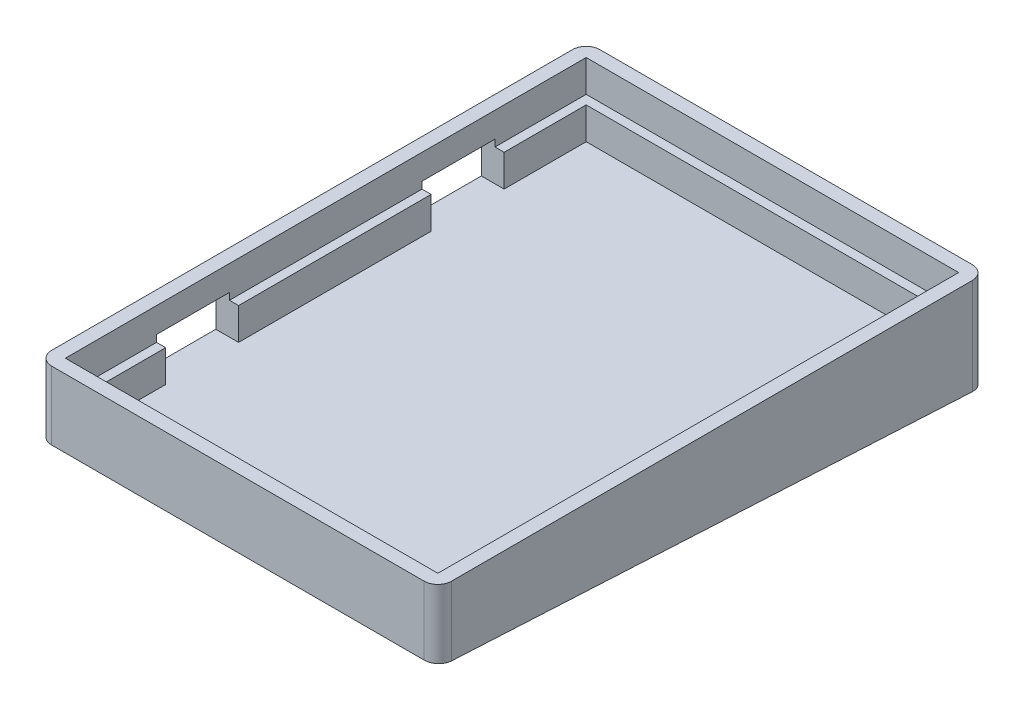
ISO-10303-21;
HEADER;
FILE_DESCRIPTION(('STEP AP214'),'2;1');
FILE_NAME('part.step','',(''),(''),'','','');
FILE_SCHEMA(('AUTOMOTIVE_DESIGN { 1 0 10303 214 1 1 1 1 }'));
ENDSEC;
DATA;
#1=APPLICATION_CONTEXT('core data for automotive mechanical design processes');
#2=APPLICATION_PROTOCOL_DEFINITION('international standard','automotive_design',2000,#1);
#3=PRODUCT_CONTEXT('',#1,'mechanical');
#4=PRODUCT('Part','Part','',(#3));
#5=PRODUCT_RELATED_PRODUCT_CATEGORY('part','',(#4));
#6=PRODUCT_DEFINITION_FORMATION('','',#4);
#7=PRODUCT_DEFINITION_CONTEXT('part definition',#1,'design');
#8=PRODUCT_DEFINITION('design','',#6,#7);
#9=PRODUCT_DEFINITION_SHAPE('','',#8);
#10=(LENGTH_UNIT() NAMED_UNIT(*) SI_UNIT(.MILLI.,.METRE.));
#11=(NAMED_UNIT(*) PLANE_ANGLE_UNIT() SI_UNIT($,.RADIAN.));
#12=(NAMED_UNIT(*) SI_UNIT($,.STERADIAN.) SOLID_ANGLE_UNIT());
#13=UNCERTAINTY_MEASURE_WITH_UNIT(LENGTH_MEASURE(1.E-05),#10,'distance_accuracy_value','');
#14=(GEOMETRIC_REPRESENTATION_CONTEXT(3) GLOBAL_UNCERTAINTY_ASSIGNED_CONTEXT((#13)) GLOBAL_UNIT_ASSIGNED_CONTEXT((#10,
#11,#12)) REPRESENTATION_CONTEXT('',''));
#15=CARTESIAN_POINT('',(0.,0.,0.));
#16=DIRECTION('',(0.,0.,1.));
#17=DIRECTION('',(1.,0.,0.));
#18=AXIS2_PLACEMENT_3D('',#15,#16,#17);
#19=CARTESIAN_POINT('',(0.,0.,0.));
#20=DIRECTION('',(0.,1.,0.));
#21=DIRECTION('',(0.,0.,1.));
#22=AXIS2_PLACEMENT_3D('',#19,#20,#21);
#23=PLANE('',#22);
#24=DIRECTION('',(1.,0.,0.));
#25=VECTOR('',#24,1.);
#26=CARTESIAN_POINT('',(0.,0.,-20.));
#27=LINE('',#26,#25);
#28=CARTESIAN_POINT('',(-3.,0.,-20.));
#29=VERTEX_POINT('',#28);
#30=CARTESIAN_POINT('',(2.,0.,-20.));
#31=VERTEX_POINT('',#30);
#32=EDGE_CURVE('E325',#29,#31,#27,.T.);
#33=ORIENTED_EDGE('',*,*,#32,.T.);
#34=DIRECTION('',(0.,0.,-1.));
#35=VECTOR('',#34,1.);
#36=CARTESIAN_POINT('',(2.,0.,-20.));
#37=LINE('',#36,#35);
#38=CARTESIAN_POINT('',(2.,0.,-2.));
#39=VERTEX_POINT('',#38);
#40=EDGE_CURVE('E819',#39,#31,#37,.T.);
#41=ORIENTED_EDGE('',*,*,#40,.F.);
#42=DIRECTION('',(-1.,0.,0.));
#43=VECTOR('',#42,1.);
#44=CARTESIAN_POINT('',(2.,0.,-2.));
#45=LINE('',#44,#43);
#46=CARTESIAN_POINT('',(79.7,0.,-2.));
#47=VERTEX_POINT('',#46);
#48=EDGE_CURVE('E822',#47,#39,#45,.T.);
#49=ORIENTED_EDGE('',*,*,#48,.F.);
#50=DIRECTION('',(0.,0.,1.));
#51=VECTOR('',#50,1.);
#52=CARTESIAN_POINT('',(79.7,0.,-2.));
#53=LINE('',#52,#51);
#54=CARTESIAN_POINT('',(79.7,0.,-112.24));
#55=VERTEX_POINT('',#54);
#56=EDGE_CURVE('E825',#55,#47,#53,.T.);
#57=ORIENTED_EDGE('',*,*,#56,.F.);
#58=DIRECTION('',(1.,0.,0.));
#59=VECTOR('',#58,1.);
#60=CARTESIAN_POINT('',(79.7,0.,-112.24));
#61=LINE('',#60,#59);
#62=CARTESIAN_POINT('',(2.,0.,-112.24));
#63=VERTEX_POINT('',#62);
#64=EDGE_CURVE('E827',#63,#55,#61,.T.);
#65=ORIENTED_EDGE('',*,*,#64,.F.);
#66=DIRECTION('',(0.,0.,-1.));
#67=VECTOR('',#66,1.);
#68=CARTESIAN_POINT('',(2.,0.,-112.24));
#69=LINE('',#68,#67);
#70=CARTESIAN_POINT('',(2.,0.,-94.24));
#71=VERTEX_POINT('',#70);
#72=EDGE_CURVE('E829',#71,#63,#69,.T.);
#73=ORIENTED_EDGE('',*,*,#72,.F.);
#74=DIRECTION('',(-1.,0.,0.));
#75=VECTOR('',#74,1.);
#76=CARTESIAN_POINT('',(0.,0.,-94.24));
#77=LINE('',#76,#75);
#78=CARTESIAN_POINT('',(-3.,0.,-94.24));
#79=VERTEX_POINT('',#78);
#80=EDGE_CURVE('E338',#71,#79,#77,.T.);
#81=ORIENTED_EDGE('',*,*,#80,.T.);
#82=DIRECTION('',(0.,0.,-1.));
#83=VECTOR('',#82,1.);
#84=CARTESIAN_POINT('',(-3.,0.,0.));
#85=LINE('',#84,#83);
#86=CARTESIAN_POINT('',(-3.,0.,-78.24));
#87=VERTEX_POINT('',#86);
#88=EDGE_CURVE('E316',#87,#79,#85,.T.);
#89=ORIENTED_EDGE('',*,*,#88,.F.);
#90=DIRECTION('',(1.,0.,0.));
#91=VECTOR('',#90,1.);
#92=CARTESIAN_POINT('',(0.,0.,-78.24));
#93=LINE('',#92,#91);
#94=CARTESIAN_POINT('',(2.,0.,-78.24));
#95=VERTEX_POINT('',#94);
#96=EDGE_CURVE('E874',#87,#95,#93,.T.);
#97=ORIENTED_EDGE('',*,*,#96,.T.);
#98=DIRECTION('',(0.,0.,-1.));
#99=VECTOR('',#98,1.);
#100=CARTESIAN_POINT('',(2.,0.,-78.24));
#101=LINE('',#100,#99);
#102=CARTESIAN_POINT('',(2.00000000000001,0.,-36.));
#103=VERTEX_POINT('',#102);
#104=EDGE_CURVE('E831',#103,#95,#101,.T.);
#105=ORIENTED_EDGE('',*,*,#104,.F.);
#106=DIRECTION('',(1.,0.,0.));
#107=VECTOR('',#106,1.);
#108=CARTESIAN_POINT('',(0.,0.,-36.));
#109=LINE('',#108,#107);
#110=CARTESIAN_POINT('',(-3.,0.,-36.));
#111=VERTEX_POINT('',#110);
#112=EDGE_CURVE('E872',#111,#103,#109,.T.);
#113=ORIENTED_EDGE('',*,*,#112,.F.);
#114=EDGE_CURVE('E326',#29,#111,#85,.T.);
#115=ORIENTED_EDGE('',*,*,#114,.F.);
#116=EDGE_LOOP('',(#33,#41,#49,#57,#65,#73,#81,#89,#97,#105,#113,#115));
#117=FACE_BOUND('',#116,.T.);
#118=ADVANCED_FACE('F95',(#117),#23,.T.);
#119=CARTESIAN_POINT('',(0.,14.,-20.));
#120=DIRECTION('',(0.,0.,-1.));
#121=DIRECTION('',(-1.,0.,0.));
#122=AXIS2_PLACEMENT_3D('',#119,#120,#121);
#123=PLANE('',#122);
#124=DIRECTION('',(-1.,0.,0.));
#125=VECTOR('',#124,1.);
#126=CARTESIAN_POINT('',(16.9189243156886,8.5,-20.));
#127=LINE('',#126,#125);
#128=CARTESIAN_POINT('',(0.,8.5,-20.));
#129=VERTEX_POINT('',#128);
#130=CARTESIAN_POINT('',(-3.,8.5,-20.));
#131=VERTEX_POINT('',#130);
#132=EDGE_CURVE('E290',#129,#131,#127,.T.);
#133=ORIENTED_EDGE('',*,*,#132,.F.);
#134=DIRECTION('',(0.,-1.,0.));
#135=VECTOR('',#134,1.);
#136=CARTESIAN_POINT('',(0.,14.,-20.));
#137=LINE('',#136,#135);
#138=CARTESIAN_POINT('',(0.,7.,-20.));
#139=VERTEX_POINT('',#138);
#140=EDGE_CURVE('E288',#129,#139,#137,.T.);
#141=ORIENTED_EDGE('',*,*,#140,.T.);
#142=DIRECTION('',(-1.,0.,0.));
#143=VECTOR('',#142,1.);
#144=CARTESIAN_POINT('',(2.,7.,-20.));
#145=LINE('',#144,#143);
#146=CARTESIAN_POINT('',(2.,7.,-20.));
#147=VERTEX_POINT('',#146);
#148=EDGE_CURVE('E823',#147,#139,#145,.T.);
#149=ORIENTED_EDGE('',*,*,#148,.F.);
#150=DIRECTION('',(0.,-1.,0.));
#151=VECTOR('',#150,1.);
#152=CARTESIAN_POINT('',(2.,7.,-20.));
#153=LINE('',#152,#151);
#154=EDGE_CURVE('E815',#147,#31,#153,.T.);
#155=ORIENTED_EDGE('',*,*,#154,.T.);
#156=ORIENTED_EDGE('',*,*,#32,.F.);
#157=DIRECTION('',(0.,-1.,0.));
#158=VECTOR('',#157,1.);
#159=CARTESIAN_POINT('',(-3.,14.,-20.));
#160=LINE('',#159,#158);
#161=EDGE_CURVE('E110',#131,#29,#160,.T.);
#162=ORIENTED_EDGE('',*,*,#161,.F.);
#163=EDGE_LOOP('',(#133,#141,#149,#155,#156,#162));
#164=FACE_BOUND('',#163,.T.);
#165=ADVANCED_FACE('F454',(#164),#123,.T.);
#166=CARTESIAN_POINT('',(0.,14.,3.));
#167=DIRECTION('',(0.,0.,-1.));
#168=DIRECTION('',(-1.,0.,0.));
#169=AXIS2_PLACEMENT_3D('',#166,#167,#168);
#170=PLANE('',#169);
#171=DIRECTION('',(1.,0.,0.));
#172=VECTOR('',#171,1.);
#173=CARTESIAN_POINT('',(0.,-1.,3.));
#174=LINE('',#173,#172);
#175=CARTESIAN_POINT('',(0.,-1.,3.));
#176=VERTEX_POINT('',#175);
#177=CARTESIAN_POINT('',(81.7,-1.,3.));
#178=VERTEX_POINT('',#177);
#179=EDGE_CURVE('E322',#176,#178,#174,.T.);
#180=ORIENTED_EDGE('',*,*,#179,.T.);
#181=DIRECTION('',(0.,-1.,0.));
#182=VECTOR('',#181,1.);
#183=CARTESIAN_POINT('',(81.7,14.,3.));
#184=LINE('',#183,#182);
#185=CARTESIAN_POINT('',(81.7,14.,3.));
#186=VERTEX_POINT('',#185);
#187=EDGE_CURVE('E12',#178,#186,#184,.F.);
#188=ORIENTED_EDGE('',*,*,#187,.T.);
#189=DIRECTION('',(1.,0.,0.));
#190=VECTOR('',#189,1.);
#191=CARTESIAN_POINT('',(0.,14.,3.));
#192=LINE('',#191,#190);
#193=CARTESIAN_POINT('',(0.,14.,3.));
#194=VERTEX_POINT('',#193);
#195=EDGE_CURVE('E334',#194,#186,#192,.T.);
#196=ORIENTED_EDGE('',*,*,#195,.F.);
#197=DIRECTION('',(0.,-1.,0.));
#198=VECTOR('',#197,1.);
#199=CARTESIAN_POINT('',(0.,-0.999999999999999,3.));
#200=LINE('',#199,#198);
#201=EDGE_CURVE('E103',#194,#176,#200,.T.);
#202=ORIENTED_EDGE('',*,*,#201,.T.);
#203=EDGE_LOOP('',(#180,#188,#196,#202));
#204=FACE_BOUND('',#203,.T.);
#205=ADVANCED_FACE('F409',(#204),#170,.F.);
#206=CARTESIAN_POINT('',(84.7,14.,0.));
#207=DIRECTION('',(-1.,0.,0.));
#208=DIRECTION('',(0.,0.,1.));
#209=AXIS2_PLACEMENT_3D('',#206,#207,#208);
#210=PLANE('',#209);
#211=DIRECTION('',(0.,-0.0523359562429372,-0.998629534754574));
#212=VECTOR('',#211,1.);
#213=CARTESIAN_POINT('',(84.7,-7.30151138099207,-117.24));
#214=LINE('',#213,#212);
#215=CARTESIAN_POINT('',(84.7,-1.1572233378491,0.));
#216=VERTEX_POINT('',#215);
#217=CARTESIAN_POINT('',(84.7,-7.14428804314296,-114.24));
#218=VERTEX_POINT('',#217);
#219=EDGE_CURVE('E313',#216,#218,#214,.T.);
#220=ORIENTED_EDGE('',*,*,#219,.T.);
#221=DIRECTION('',(0.,-1.,0.));
#222=VECTOR('',#221,1.);
#223=CARTESIAN_POINT('',(84.7,14.,-114.24));
#224=LINE('',#223,#222);
#225=CARTESIAN_POINT('',(84.7,14.,-114.24));
#226=VERTEX_POINT('',#225);
#227=EDGE_CURVE('E403',#218,#226,#224,.F.);
#228=ORIENTED_EDGE('',*,*,#227,.T.);
#229=DIRECTION('',(0.,0.,-1.));
#230=VECTOR('',#229,1.);
#231=CARTESIAN_POINT('',(84.7,14.,0.));
#232=LINE('',#231,#230);
#233=CARTESIAN_POINT('',(84.7,14.,0.));
#234=VERTEX_POINT('',#233);
#235=EDGE_CURVE('E337',#234,#226,#232,.T.);
#236=ORIENTED_EDGE('',*,*,#235,.F.);
#237=DIRECTION('',(0.,-1.,0.));
#238=VECTOR('',#237,1.);
#239=CARTESIAN_POINT('',(84.7,14.,0.));
#240=LINE('',#239,#238);
#241=EDGE_CURVE('E400',#234,#216,#240,.T.);
#242=ORIENTED_EDGE('',*,*,#241,.T.);
#243=EDGE_LOOP('',(#220,#228,#236,#242));
#244=FACE_BOUND('',#243,.T.);
#245=ADVANCED_FACE('F423',(#244),#210,.F.);
#246=CARTESIAN_POINT('',(0.,14.,-117.24));
#247=DIRECTION('',(0.,0.,1.));
#248=DIRECTION('',(1.,0.,0.));
#249=AXIS2_PLACEMENT_3D('',#246,#247,#248);
#250=PLANE('',#249);
#251=DIRECTION('',(-1.,0.,0.));
#252=VECTOR('',#251,1.);
#253=CARTESIAN_POINT('',(205.161486245384,-7.30151138099207,-117.24));
#254=LINE('',#253,#252);
#255=CARTESIAN_POINT('',(81.7,-7.30151138099207,-117.24));
#256=VERTEX_POINT('',#255);
#257=CARTESIAN_POINT('',(0.,-7.30151138099207,-117.24));
#258=VERTEX_POINT('',#257);
#259=EDGE_CURVE('E317',#256,#258,#254,.T.);
#260=ORIENTED_EDGE('',*,*,#259,.T.);
#261=DIRECTION('',(0.,-1.,0.));
#262=VECTOR('',#261,1.);
#263=CARTESIAN_POINT('',(0.,14.,-117.24));
#264=LINE('',#263,#262);
#265=CARTESIAN_POINT('',(0.,14.,-117.24));
#266=VERTEX_POINT('',#265);
#267=EDGE_CURVE('E390',#258,#266,#264,.F.);
#268=ORIENTED_EDGE('',*,*,#267,.T.);
#269=DIRECTION('',(-1.,0.,0.));
#270=VECTOR('',#269,1.);
#271=CARTESIAN_POINT('',(0.,14.,-117.24));
#272=LINE('',#271,#270);
#273=CARTESIAN_POINT('',(81.7,14.,-117.24));
#274=VERTEX_POINT('',#273);
#275=EDGE_CURVE('E333',#274,#266,#272,.T.);
#276=ORIENTED_EDGE('',*,*,#275,.F.);
#277=DIRECTION('',(0.,-1.,0.));
#278=VECTOR('',#277,1.);
#279=CARTESIAN_POINT('',(81.7,14.,-117.24));
#280=LINE('',#279,#278);
#281=EDGE_CURVE('E387',#274,#256,#280,.T.);
#282=ORIENTED_EDGE('',*,*,#281,.T.);
#283=EDGE_LOOP('',(#260,#268,#276,#282));
#284=FACE_BOUND('',#283,.T.);
#285=ADVANCED_FACE('F435',(#284),#250,.F.);
#286=CARTESIAN_POINT('',(-3.,14.,0.));
#287=DIRECTION('',(-1.,0.,0.));
#288=DIRECTION('',(0.,0.,1.));
#289=AXIS2_PLACEMENT_3D('',#286,#287,#288);
#290=PLANE('',#289);
#291=DIRECTION('',(0.,0.,1.));
#292=VECTOR('',#291,1.);
#293=CARTESIAN_POINT('',(-3.,8.5,-36.));
#294=LINE('',#293,#292);
#295=CARTESIAN_POINT('',(-3.,8.5,-36.));
#296=VERTEX_POINT('',#295);
#297=EDGE_CURVE('E296',#296,#131,#294,.T.);
#298=ORIENTED_EDGE('',*,*,#297,.T.);
#299=ORIENTED_EDGE('',*,*,#161,.T.);
#300=ORIENTED_EDGE('',*,*,#114,.T.);
#301=DIRECTION('',(0.,-1.,0.));
#302=VECTOR('',#301,1.);
#303=CARTESIAN_POINT('',(-3.,14.,-36.));
#304=LINE('',#303,#302);
#305=EDGE_CURVE('E304',#296,#111,#304,.T.);
#306=ORIENTED_EDGE('',*,*,#305,.F.);
#307=EDGE_LOOP('',(#298,#299,#300,#306));
#308=FACE_BOUND('',#307,.T.);
#309=DIRECTION('',(0.,-1.,0.));
#310=VECTOR('',#309,1.);
#311=CARTESIAN_POINT('',(-3.,14.,-94.24));
#312=LINE('',#311,#310);
#313=CARTESIAN_POINT('',(-3.,8.5,-94.24));
#314=VERTEX_POINT('',#313);
#315=EDGE_CURVE('E370',#314,#79,#312,.T.);
#316=ORIENTED_EDGE('',*,*,#315,.F.);
#317=DIRECTION('',(0.,0.,1.));
#318=VECTOR('',#317,1.);
#319=CARTESIAN_POINT('',(-3.,8.5,-94.24));
#320=LINE('',#319,#318);
#321=CARTESIAN_POINT('',(-3.,8.5,-78.24));
#322=VERTEX_POINT('',#321);
#323=EDGE_CURVE('E802',#314,#322,#320,.T.);
#324=ORIENTED_EDGE('',*,*,#323,.T.);
#325=DIRECTION('',(0.,-1.,0.));
#326=VECTOR('',#325,1.);
#327=CARTESIAN_POINT('',(-3.,14.,-78.24));
#328=LINE('',#327,#326);
#329=EDGE_CURVE('E309',#322,#87,#328,.T.);
#330=ORIENTED_EDGE('',*,*,#329,.T.);
#331=ORIENTED_EDGE('',*,*,#88,.T.);
#332=EDGE_LOOP('',(#316,#324,#330,#331));
#333=FACE_BOUND('',#332,.T.);
#334=DIRECTION('',(0.,0.,-1.));
#335=VECTOR('',#334,1.);
#336=CARTESIAN_POINT('',(-3.,14.,0.));
#337=LINE('',#336,#335);
#338=CARTESIAN_POINT('',(-3.,14.,0.));
#339=VERTEX_POINT('',#338);
#340=CARTESIAN_POINT('',(-3.,14.,-114.24));
#341=VERTEX_POINT('',#340);
#342=EDGE_CURVE('E329',#339,#341,#337,.T.);
#343=ORIENTED_EDGE('',*,*,#342,.T.);
#344=DIRECTION('',(0.,-1.,0.));
#345=VECTOR('',#344,1.);
#346=CARTESIAN_POINT('',(-3.,-7.30151138099207,-114.24));
#347=LINE('',#346,#345);
#348=CARTESIAN_POINT('',(-3.,-7.14428804314296,-114.24));
#349=VERTEX_POINT('',#348);
#350=EDGE_CURVE('E376',#341,#349,#347,.T.);
#351=ORIENTED_EDGE('',*,*,#350,.T.);
#352=DIRECTION('',(0.,0.0523359562429372,0.998629534754574));
#353=VECTOR('',#352,1.);
#354=CARTESIAN_POINT('',(-3.,-7.30151138099207,-117.24));
#355=LINE('',#354,#353);
#356=CARTESIAN_POINT('',(-3.,-1.1572233378491,0.));
#357=VERTEX_POINT('',#356);
#358=EDGE_CURVE('E307',#349,#357,#355,.T.);
#359=ORIENTED_EDGE('',*,*,#358,.T.);
#360=DIRECTION('',(0.,-1.,0.));
#361=VECTOR('',#360,1.);
#362=CARTESIAN_POINT('',(-3.,14.,0.));
#363=LINE('',#362,#361);
#364=EDGE_CURVE('E373',#357,#339,#363,.F.);
#365=ORIENTED_EDGE('',*,*,#364,.T.);
#366=EDGE_LOOP('',(#343,#351,#359,#365));
#367=FACE_BOUND('',#366,.T.);
#368=ADVANCED_FACE('F442',(#308,#333,#367),#290,.T.);
#369=CARTESIAN_POINT('',(0.,14.,-94.24));
#370=DIRECTION('',(0.,0.,1.));
#371=DIRECTION('',(1.,0.,0.));
#372=AXIS2_PLACEMENT_3D('',#369,#370,#371);
#373=PLANE('',#372);
#374=DIRECTION('',(-1.,0.,0.));
#375=VECTOR('',#374,1.);
#376=CARTESIAN_POINT('',(16.9189243156886,8.5,-94.24));
#377=LINE('',#376,#375);
#378=CARTESIAN_POINT('',(0.,8.5,-94.24));
#379=VERTEX_POINT('',#378);
#380=EDGE_CURVE('E118',#379,#314,#377,.T.);
#381=ORIENTED_EDGE('',*,*,#380,.T.);
#382=ORIENTED_EDGE('',*,*,#315,.T.);
#383=ORIENTED_EDGE('',*,*,#80,.F.);
#384=DIRECTION('',(0.,-1.,0.));
#385=VECTOR('',#384,1.);
#386=CARTESIAN_POINT('',(2.,7.,-94.24));
#387=LINE('',#386,#385);
#388=CARTESIAN_POINT('',(2.,7.,-94.24));
#389=VERTEX_POINT('',#388);
#390=EDGE_CURVE('E793',#389,#71,#387,.T.);
#391=ORIENTED_EDGE('',*,*,#390,.F.);
#392=DIRECTION('',(1.,0.,0.));
#393=VECTOR('',#392,1.);
#394=CARTESIAN_POINT('',(2.,7.,-94.24));
#395=LINE('',#394,#393);
#396=CARTESIAN_POINT('',(0.,7.,-94.24));
#397=VERTEX_POINT('',#396);
#398=EDGE_CURVE('E841',#397,#389,#395,.T.);
#399=ORIENTED_EDGE('',*,*,#398,.F.);
#400=DIRECTION('',(0.,-1.,0.));
#401=VECTOR('',#400,1.);
#402=CARTESIAN_POINT('',(0.,14.,-94.24));
#403=LINE('',#402,#401);
#404=EDGE_CURVE('E368',#379,#397,#403,.T.);
#405=ORIENTED_EDGE('',*,*,#404,.F.);
#406=EDGE_LOOP('',(#381,#382,#383,#391,#399,#405));
#407=FACE_BOUND('',#406,.T.);
#408=ADVANCED_FACE('F479',(#407),#373,.T.);
#409=CARTESIAN_POINT('',(0.,14.,-114.24));
#410=DIRECTION('',(0.,0.,1.));
#411=DIRECTION('',(1.,0.,0.));
#412=AXIS2_PLACEMENT_3D('',#409,#410,#411);
#413=PLANE('',#412);
#414=DIRECTION('',(-1.,0.,0.));
#415=VECTOR('',#414,1.);
#416=CARTESIAN_POINT('',(81.7,7.,-114.24));
#417=LINE('',#416,#415);
#418=CARTESIAN_POINT('',(81.7,7.,-114.24));
#419=VERTEX_POINT('',#418);
#420=CARTESIAN_POINT('',(0.,7.,-114.24));
#421=VERTEX_POINT('',#420);
#422=EDGE_CURVE('E846',#419,#421,#417,.T.);
#423=ORIENTED_EDGE('',*,*,#422,.F.);
#424=DIRECTION('',(0.,-1.,0.));
#425=VECTOR('',#424,1.);
#426=CARTESIAN_POINT('',(81.7,14.,-114.24));
#427=LINE('',#426,#425);
#428=CARTESIAN_POINT('',(81.7,14.,-114.24));
#429=VERTEX_POINT('',#428);
#430=EDGE_CURVE('E362',#429,#419,#427,.T.);
#431=ORIENTED_EDGE('',*,*,#430,.F.);
#432=DIRECTION('',(-1.,0.,0.));
#433=VECTOR('',#432,1.);
#434=CARTESIAN_POINT('',(0.,14.,-114.24));
#435=LINE('',#434,#433);
#436=CARTESIAN_POINT('',(0.,14.,-114.24));
#437=VERTEX_POINT('',#436);
#438=EDGE_CURVE('E344',#429,#437,#435,.T.);
#439=ORIENTED_EDGE('',*,*,#438,.T.);
#440=DIRECTION('',(0.,-1.,0.));
#441=VECTOR('',#440,1.);
#442=CARTESIAN_POINT('',(0.,14.,-114.24));
#443=LINE('',#442,#441);
#444=EDGE_CURVE('E365',#437,#421,#443,.T.);
#445=ORIENTED_EDGE('',*,*,#444,.T.);
#446=EDGE_LOOP('',(#423,#431,#439,#445));
#447=FACE_BOUND('',#446,.T.);
#448=ADVANCED_FACE('F476',(#447),#413,.T.);
#449=CARTESIAN_POINT('',(81.7,14.,0.));
#450=DIRECTION('',(-1.,0.,0.));
#451=DIRECTION('',(0.,0.,1.));
#452=AXIS2_PLACEMENT_3D('',#449,#450,#451);
#453=PLANE('',#452);
#454=DIRECTION('',(0.,0.,-1.));
#455=VECTOR('',#454,1.);
#456=CARTESIAN_POINT('',(81.7,7.,0.));
#457=LINE('',#456,#455);
#458=CARTESIAN_POINT('',(81.7,7.,0.));
#459=VERTEX_POINT('',#458);
#460=EDGE_CURVE('E848',#459,#419,#457,.T.);
#461=ORIENTED_EDGE('',*,*,#460,.F.);
#462=DIRECTION('',(0.,-1.,0.));
#463=VECTOR('',#462,1.);
#464=CARTESIAN_POINT('',(81.7,14.,0.));
#465=LINE('',#464,#463);
#466=CARTESIAN_POINT('',(81.7,14.,0.));
#467=VERTEX_POINT('',#466);
#468=EDGE_CURVE('E359',#467,#459,#465,.T.);
#469=ORIENTED_EDGE('',*,*,#468,.F.);
#470=DIRECTION('',(0.,0.,-1.));
#471=VECTOR('',#470,1.);
#472=CARTESIAN_POINT('',(81.7,14.,0.));
#473=LINE('',#472,#471);
#474=EDGE_CURVE('E347',#467,#429,#473,.T.);
#475=ORIENTED_EDGE('',*,*,#474,.T.);
#476=ORIENTED_EDGE('',*,*,#430,.T.);
#477=EDGE_LOOP('',(#461,#469,#475,#476));
#478=FACE_BOUND('',#477,.T.);
#479=ADVANCED_FACE('F472',(#478),#453,.T.);
#480=CARTESIAN_POINT('',(0.,14.,0.));
#481=DIRECTION('',(0.,0.,-1.));
#482=DIRECTION('',(-1.,0.,0.));
#483=AXIS2_PLACEMENT_3D('',#480,#481,#482);
#484=PLANE('',#483);
#485=DIRECTION('',(1.,0.,0.));
#486=VECTOR('',#485,1.);
#487=CARTESIAN_POINT('',(0.,7.,0.));
#488=LINE('',#487,#486);
#489=CARTESIAN_POINT('',(0.,7.,0.));
#490=VERTEX_POINT('',#489);
#491=EDGE_CURVE('E850',#490,#459,#488,.T.);
#492=ORIENTED_EDGE('',*,*,#491,.F.);
#493=DIRECTION('',(0.,-1.,0.));
#494=VECTOR('',#493,1.);
#495=CARTESIAN_POINT('',(0.,14.,0.));
#496=LINE('',#495,#494);
#497=CARTESIAN_POINT('',(0.,14.,0.));
#498=VERTEX_POINT('',#497);
#499=EDGE_CURVE('E357',#498,#490,#496,.T.);
#500=ORIENTED_EDGE('',*,*,#499,.F.);
#501=DIRECTION('',(1.,0.,0.));
#502=VECTOR('',#501,1.);
#503=CARTESIAN_POINT('',(0.,14.,0.));
#504=LINE('',#503,#502);
#505=EDGE_CURVE('E350',#498,#467,#504,.T.);
#506=ORIENTED_EDGE('',*,*,#505,.T.);
#507=ORIENTED_EDGE('',*,*,#468,.T.);
#508=EDGE_LOOP('',(#492,#500,#506,#507));
#509=FACE_BOUND('',#508,.T.);
#510=ADVANCED_FACE('F469',(#509),#484,.T.);
#511=CARTESIAN_POINT('',(0.,14.,0.));
#512=DIRECTION('',(-1.,0.,0.));
#513=DIRECTION('',(0.,0.,1.));
#514=AXIS2_PLACEMENT_3D('',#511,#512,#513);
#515=PLANE('',#514);
#516=ORIENTED_EDGE('',*,*,#499,.T.);
#517=DIRECTION('',(0.,0.,1.));
#518=VECTOR('',#517,1.);
#519=CARTESIAN_POINT('',(0.,7.,-20.));
#520=LINE('',#519,#518);
#521=EDGE_CURVE('E852',#139,#490,#520,.T.);
#522=ORIENTED_EDGE('',*,*,#521,.F.);
#523=ORIENTED_EDGE('',*,*,#140,.F.);
#524=DIRECTION('',(0.,0.,-1.));
#525=VECTOR('',#524,1.);
#526=CARTESIAN_POINT('',(0.,8.5,-36.));
#527=LINE('',#526,#525);
#528=CARTESIAN_POINT('',(0.,8.5,-36.));
#529=VERTEX_POINT('',#528);
#530=EDGE_CURVE('E279',#129,#529,#527,.T.);
#531=ORIENTED_EDGE('',*,*,#530,.T.);
#532=DIRECTION('',(0.,-1.,0.));
#533=VECTOR('',#532,1.);
#534=CARTESIAN_POINT('',(0.,14.,-36.));
#535=LINE('',#534,#533);
#536=CARTESIAN_POINT('',(0.,7.,-36.));
#537=VERTEX_POINT('',#536);
#538=EDGE_CURVE('E285',#529,#537,#535,.T.);
#539=ORIENTED_EDGE('',*,*,#538,.T.);
#540=DIRECTION('',(0.,0.,1.));
#541=VECTOR('',#540,1.);
#542=CARTESIAN_POINT('',(0.,7.,-78.24));
#543=LINE('',#542,#541);
#544=CARTESIAN_POINT('',(0.,7.,-78.24));
#545=VERTEX_POINT('',#544);
#546=EDGE_CURVE('E856',#545,#537,#543,.T.);
#547=ORIENTED_EDGE('',*,*,#546,.F.);
#548=DIRECTION('',(0.,-1.,0.));
#549=VECTOR('',#548,1.);
#550=CARTESIAN_POINT('',(0.,14.,-78.24));
#551=LINE('',#550,#549);
#552=CARTESIAN_POINT('',(0.,8.5,-78.24));
#553=VERTEX_POINT('',#552);
#554=EDGE_CURVE('E305',#553,#545,#551,.T.);
#555=ORIENTED_EDGE('',*,*,#554,.F.);
#556=DIRECTION('',(0.,0.,-1.));
#557=VECTOR('',#556,1.);
#558=CARTESIAN_POINT('',(0.,8.5,-94.24));
#559=LINE('',#558,#557);
#560=EDGE_CURVE('E788',#553,#379,#559,.T.);
#561=ORIENTED_EDGE('',*,*,#560,.T.);
#562=ORIENTED_EDGE('',*,*,#404,.T.);
#563=DIRECTION('',(0.,0.,1.));
#564=VECTOR('',#563,1.);
#565=CARTESIAN_POINT('',(0.,7.,-114.24));
#566=LINE('',#565,#564);
#567=EDGE_CURVE('E843',#421,#397,#566,.T.);
#568=ORIENTED_EDGE('',*,*,#567,.F.);
#569=ORIENTED_EDGE('',*,*,#444,.F.);
#570=DIRECTION('',(0.,0.,-1.));
#571=VECTOR('',#570,1.);
#572=CARTESIAN_POINT('',(0.,14.,0.));
#573=LINE('',#572,#571);
#574=EDGE_CURVE('E332',#498,#437,#573,.T.);
#575=ORIENTED_EDGE('',*,*,#574,.F.);
#576=EDGE_LOOP('',(#516,#522,#523,#531,#539,#547,#555,#561,#562,#568,#569,#575));
#577=FACE_BOUND('',#576,.T.);
#578=ADVANCED_FACE('F282',(#577),#515,.F.);
#579=CARTESIAN_POINT('',(0.,14.,0.));
#580=DIRECTION('',(0.,1.,0.));
#581=DIRECTION('',(0.,0.,1.));
#582=AXIS2_PLACEMENT_3D('',#579,#580,#581);
#583=PLANE('',#582);
#584=ORIENTED_EDGE('',*,*,#342,.F.);
#585=CARTESIAN_POINT('',(0.,14.,0.));
#586=DIRECTION('',(0.,1.,0.));
#587=DIRECTION('',(0.,0.,1.));
#588=AXIS2_PLACEMENT_3D('',#585,#586,#587);
#589=CIRCLE('',#588,3.);
#590=EDGE_CURVE('E392',#339,#194,#589,.T.);
#591=ORIENTED_EDGE('',*,*,#590,.T.);
#592=ORIENTED_EDGE('',*,*,#195,.T.);
#593=CARTESIAN_POINT('',(81.7,14.,0.));
#594=DIRECTION('',(0.,1.,0.));
#595=DIRECTION('',(0.,0.,1.));
#596=AXIS2_PLACEMENT_3D('',#593,#594,#595);
#597=CIRCLE('',#596,3.);
#598=EDGE_CURVE('E394',#186,#234,#597,.T.);
#599=ORIENTED_EDGE('',*,*,#598,.T.);
#600=ORIENTED_EDGE('',*,*,#235,.T.);
#601=CARTESIAN_POINT('',(81.7,14.,-114.24));
#602=DIRECTION('',(0.,1.,0.));
#603=DIRECTION('',(0.,0.,1.));
#604=AXIS2_PLACEMENT_3D('',#601,#602,#603);
#605=CIRCLE('',#604,3.);
#606=EDGE_CURVE('E396',#226,#274,#605,.T.);
#607=ORIENTED_EDGE('',*,*,#606,.T.);
#608=ORIENTED_EDGE('',*,*,#275,.T.);
#609=CARTESIAN_POINT('',(0.,14.,-114.24));
#610=DIRECTION('',(0.,1.,0.));
#611=DIRECTION('',(0.,0.,1.));
#612=AXIS2_PLACEMENT_3D('',#609,#610,#611);
#613=CIRCLE('',#612,3.);
#614=EDGE_CURVE('E398',#266,#341,#613,.T.);
#615=ORIENTED_EDGE('',*,*,#614,.T.);
#616=EDGE_LOOP('',(#584,#591,#592,#599,#600,#607,#608,#615));
#617=FACE_BOUND('',#616,.T.);
#618=ORIENTED_EDGE('',*,*,#505,.F.);
#619=ORIENTED_EDGE('',*,*,#574,.T.);
#620=ORIENTED_EDGE('',*,*,#438,.F.);
#621=ORIENTED_EDGE('',*,*,#474,.F.);
#622=EDGE_LOOP('',(#618,#619,#620,#621));
#623=FACE_BOUND('',#622,.T.);
#624=ADVANCED_FACE('F427',(#617,#623),#583,.T.);
#625=CARTESIAN_POINT('',(205.161486245384,-7.30151138099207,-117.24));
#626=DIRECTION('',(0.,-0.998629534754574,0.0523359562429372));
#627=DIRECTION('',(0.,-0.0523359562429372,-0.998629534754574));
#628=AXIS2_PLACEMENT_3D('',#625,#626,#627);
#629=PLANE('',#628);
#630=ORIENTED_EDGE('',*,*,#358,.F.);
#631=CARTESIAN_POINT('',(0.,-7.14428804314296,-114.24));
#632=DIRECTION('',(0.,-0.998629534754574,0.0523359562429372));
#633=DIRECTION('',(0.,0.0523359562429372,0.998629534754574));
#634=AXIS2_PLACEMENT_3D('',#631,#632,#633);
#635=ELLIPSE('',#634,3.00411703799376,3.);
#636=EDGE_CURVE('E385',#349,#258,#635,.T.);
#637=ORIENTED_EDGE('',*,*,#636,.T.);
#638=ORIENTED_EDGE('',*,*,#259,.F.);
#639=CARTESIAN_POINT('',(81.7,-7.14428804314296,-114.24));
#640=DIRECTION('',(0.,-0.998629534754574,0.0523359562429372));
#641=DIRECTION('',(0.,-0.0523359562429372,-0.998629534754574));
#642=AXIS2_PLACEMENT_3D('',#639,#640,#641);
#643=ELLIPSE('',#642,3.00411703799376,3.);
#644=EDGE_CURVE('E383',#256,#218,#643,.T.);
#645=ORIENTED_EDGE('',*,*,#644,.T.);
#646=ORIENTED_EDGE('',*,*,#219,.F.);
#647=CARTESIAN_POINT('',(81.7,-1.1572233378491,0.));
#648=DIRECTION('',(0.,-0.998629534754574,0.0523359562429372));
#649=DIRECTION('',(0.,-0.0523359562429372,-0.998629534754574));
#650=AXIS2_PLACEMENT_3D('',#647,#648,#649);
#651=ELLIPSE('',#650,3.00411703799376,3.);
#652=EDGE_CURVE('E381',#216,#178,#651,.T.);
#653=ORIENTED_EDGE('',*,*,#652,.T.);
#654=ORIENTED_EDGE('',*,*,#179,.F.);
#655=CARTESIAN_POINT('',(0.,-1.1572233378491,0.));
#656=DIRECTION('',(0.,-0.998629534754574,0.0523359562429372));
#657=DIRECTION('',(0.,0.0523359562429372,0.998629534754574));
#658=AXIS2_PLACEMENT_3D('',#655,#656,#657);
#659=ELLIPSE('',#658,3.00411703799376,3.);
#660=EDGE_CURVE('E379',#176,#357,#659,.T.);
#661=ORIENTED_EDGE('',*,*,#660,.T.);
#662=EDGE_LOOP('',(#630,#637,#638,#645,#646,#653,#654,#661));
#663=FACE_BOUND('',#662,.T.);
#664=ADVANCED_FACE('F415',(#663),#629,.T.);
#665=CARTESIAN_POINT('',(0.,14.,-36.));
#666=DIRECTION('',(0.,0.,-1.));
#667=DIRECTION('',(-1.,0.,0.));
#668=AXIS2_PLACEMENT_3D('',#665,#666,#667);
#669=PLANE('',#668);
#670=ORIENTED_EDGE('',*,*,#538,.F.);
#671=DIRECTION('',(-1.,0.,0.));
#672=VECTOR('',#671,1.);
#673=CARTESIAN_POINT('',(16.9189243156886,8.5,-36.));
#674=LINE('',#673,#672);
#675=EDGE_CURVE('E293',#529,#296,#674,.T.);
#676=ORIENTED_EDGE('',*,*,#675,.T.);
#677=ORIENTED_EDGE('',*,*,#305,.T.);
#678=ORIENTED_EDGE('',*,*,#112,.T.);
#679=DIRECTION('',(0.,-1.,0.));
#680=VECTOR('',#679,1.);
#681=CARTESIAN_POINT('',(2.00000000000001,7.,-36.));
#682=LINE('',#681,#680);
#683=CARTESIAN_POINT('',(2.00000000000001,7.,-36.));
#684=VERTEX_POINT('',#683);
#685=EDGE_CURVE('E869',#684,#103,#682,.T.);
#686=ORIENTED_EDGE('',*,*,#685,.F.);
#687=DIRECTION('',(1.,0.,0.));
#688=VECTOR('',#687,1.);
#689=CARTESIAN_POINT('',(2.00000000000001,7.,-36.));
#690=LINE('',#689,#688);
#691=EDGE_CURVE('E302',#537,#684,#690,.T.);
#692=ORIENTED_EDGE('',*,*,#691,.F.);
#693=EDGE_LOOP('',(#670,#676,#677,#678,#686,#692));
#694=FACE_BOUND('',#693,.T.);
#695=ADVANCED_FACE('F300',(#694),#669,.F.);
#696=CARTESIAN_POINT('',(0.,14.,-78.24));
#697=DIRECTION('',(0.,0.,-1.));
#698=DIRECTION('',(-1.,0.,0.));
#699=AXIS2_PLACEMENT_3D('',#696,#697,#698);
#700=PLANE('',#699);
#701=DIRECTION('',(-1.,0.,0.));
#702=VECTOR('',#701,1.);
#703=CARTESIAN_POINT('',(16.9189243156886,8.5,-78.24));
#704=LINE('',#703,#702);
#705=EDGE_CURVE('E790',#553,#322,#704,.T.);
#706=ORIENTED_EDGE('',*,*,#705,.F.);
#707=ORIENTED_EDGE('',*,*,#554,.T.);
#708=DIRECTION('',(-1.,0.,0.));
#709=VECTOR('',#708,1.);
#710=CARTESIAN_POINT('',(2.,7.,-78.24));
#711=LINE('',#710,#709);
#712=CARTESIAN_POINT('',(2.,7.,-78.24));
#713=VERTEX_POINT('',#712);
#714=EDGE_CURVE('E861',#713,#545,#711,.T.);
#715=ORIENTED_EDGE('',*,*,#714,.F.);
#716=DIRECTION('',(0.,-1.,0.));
#717=VECTOR('',#716,1.);
#718=CARTESIAN_POINT('',(2.,7.,-78.24));
#719=LINE('',#718,#717);
#720=EDGE_CURVE('E864',#713,#95,#719,.T.);
#721=ORIENTED_EDGE('',*,*,#720,.T.);
#722=ORIENTED_EDGE('',*,*,#96,.F.);
#723=ORIENTED_EDGE('',*,*,#329,.F.);
#724=EDGE_LOOP('',(#706,#707,#715,#721,#722,#723));
#725=FACE_BOUND('',#724,.T.);
#726=ADVANCED_FACE('F494',(#725),#700,.T.);
#727=CARTESIAN_POINT('',(0.,14.,-114.24));
#728=DIRECTION('',(0.,1.,0.));
#729=DIRECTION('',(0.,0.,1.));
#730=AXIS2_PLACEMENT_3D('',#727,#728,#729);
#731=CYLINDRICAL_SURFACE('',#730,3.);
#732=ORIENTED_EDGE('',*,*,#614,.F.);
#733=ORIENTED_EDGE('',*,*,#267,.F.);
#734=ORIENTED_EDGE('',*,*,#636,.F.);
#735=ORIENTED_EDGE('',*,*,#350,.F.);
#736=EDGE_LOOP('',(#732,#733,#734,#735));
#737=FACE_BOUND('',#736,.T.);
#738=ADVANCED_FACE('F440',(#737),#731,.T.);
#739=CARTESIAN_POINT('',(81.7,14.,-114.24));
#740=DIRECTION('',(0.,-1.,0.));
#741=DIRECTION('',(0.,0.,-1.));
#742=AXIS2_PLACEMENT_3D('',#739,#740,#741);
#743=CYLINDRICAL_SURFACE('',#742,3.);
#744=ORIENTED_EDGE('',*,*,#606,.F.);
#745=ORIENTED_EDGE('',*,*,#227,.F.);
#746=ORIENTED_EDGE('',*,*,#644,.F.);
#747=ORIENTED_EDGE('',*,*,#281,.F.);
#748=EDGE_LOOP('',(#744,#745,#746,#747));
#749=FACE_BOUND('',#748,.T.);
#750=ADVANCED_FACE('F432',(#749),#743,.T.);
#751=CARTESIAN_POINT('',(81.7,14.,0.));
#752=DIRECTION('',(0.,-1.,0.));
#753=DIRECTION('',(0.,0.,-1.));
#754=AXIS2_PLACEMENT_3D('',#751,#752,#753);
#755=CYLINDRICAL_SURFACE('',#754,3.);
#756=ORIENTED_EDGE('',*,*,#598,.F.);
#757=ORIENTED_EDGE('',*,*,#187,.F.);
#758=ORIENTED_EDGE('',*,*,#652,.F.);
#759=ORIENTED_EDGE('',*,*,#241,.F.);
#760=EDGE_LOOP('',(#756,#757,#758,#759));
#761=FACE_BOUND('',#760,.T.);
#762=ADVANCED_FACE('F420',(#761),#755,.T.);
#763=CARTESIAN_POINT('',(0.,14.,0.));
#764=DIRECTION('',(0.,1.,0.));
#765=DIRECTION('',(0.,0.,1.));
#766=AXIS2_PLACEMENT_3D('',#763,#764,#765);
#767=CYLINDRICAL_SURFACE('',#766,3.);
#768=ORIENTED_EDGE('',*,*,#590,.F.);
#769=ORIENTED_EDGE('',*,*,#364,.F.);
#770=ORIENTED_EDGE('',*,*,#660,.F.);
#771=ORIENTED_EDGE('',*,*,#201,.F.);
#772=EDGE_LOOP('',(#768,#769,#770,#771));
#773=FACE_BOUND('',#772,.T.);
#774=ADVANCED_FACE('F97',(#773),#767,.T.);
#775=CARTESIAN_POINT('',(2.,7.,-78.24));
#776=DIRECTION('',(-1.,0.,0.));
#777=DIRECTION('',(0.,0.,1.));
#778=AXIS2_PLACEMENT_3D('',#775,#776,#777);
#779=PLANE('',#778);
#780=ORIENTED_EDGE('',*,*,#104,.T.);
#781=ORIENTED_EDGE('',*,*,#720,.F.);
#782=DIRECTION('',(0.,0.,-1.));
#783=VECTOR('',#782,1.);
#784=CARTESIAN_POINT('',(2.,7.,-78.24));
#785=LINE('',#784,#783);
#786=EDGE_CURVE('E859',#684,#713,#785,.T.);
#787=ORIENTED_EDGE('',*,*,#786,.F.);
#788=ORIENTED_EDGE('',*,*,#685,.T.);
#789=EDGE_LOOP('',(#780,#781,#787,#788));
#790=FACE_BOUND('',#789,.T.);
#791=ADVANCED_FACE('F445',(#790),#779,.F.);
#792=CARTESIAN_POINT('',(0.,7.,0.));
#793=DIRECTION('',(0.,-1.,0.));
#794=DIRECTION('',(0.,0.,-1.));
#795=AXIS2_PLACEMENT_3D('',#792,#793,#794);
#796=PLANE('',#795);
#797=ORIENTED_EDGE('',*,*,#546,.T.);
#798=ORIENTED_EDGE('',*,*,#691,.T.);
#799=ORIENTED_EDGE('',*,*,#786,.T.);
#800=ORIENTED_EDGE('',*,*,#714,.T.);
#801=EDGE_LOOP('',(#797,#798,#799,#800));
#802=FACE_BOUND('',#801,.T.);
#803=ADVANCED_FACE('F451',(#802),#796,.F.);
#804=CARTESIAN_POINT('',(2.,7.,-112.24));
#805=DIRECTION('',(-1.,0.,0.));
#806=DIRECTION('',(0.,0.,1.));
#807=AXIS2_PLACEMENT_3D('',#804,#805,#806);
#808=PLANE('',#807);
#809=ORIENTED_EDGE('',*,*,#72,.T.);
#810=DIRECTION('',(0.,-1.,0.));
#811=VECTOR('',#810,1.);
#812=CARTESIAN_POINT('',(2.,7.,-112.24));
#813=LINE('',#812,#811);
#814=CARTESIAN_POINT('',(2.,7.,-112.24));
#815=VERTEX_POINT('',#814);
#816=EDGE_CURVE('E796',#815,#63,#813,.T.);
#817=ORIENTED_EDGE('',*,*,#816,.F.);
#818=DIRECTION('',(0.,0.,-1.));
#819=VECTOR('',#818,1.);
#820=CARTESIAN_POINT('',(2.,7.,-112.24));
#821=LINE('',#820,#819);
#822=EDGE_CURVE('E839',#389,#815,#821,.T.);
#823=ORIENTED_EDGE('',*,*,#822,.F.);
#824=ORIENTED_EDGE('',*,*,#390,.T.);
#825=EDGE_LOOP('',(#809,#817,#823,#824));
#826=FACE_BOUND('',#825,.T.);
#827=ADVANCED_FACE('F580',(#826),#808,.F.);
#828=CARTESIAN_POINT('',(79.7,7.,-112.24));
#829=DIRECTION('',(0.,0.,-1.));
#830=DIRECTION('',(-1.,0.,0.));
#831=AXIS2_PLACEMENT_3D('',#828,#829,#830);
#832=PLANE('',#831);
#833=ORIENTED_EDGE('',*,*,#64,.T.);
#834=DIRECTION('',(0.,-1.,0.));
#835=VECTOR('',#834,1.);
#836=CARTESIAN_POINT('',(79.7,7.,-112.24));
#837=LINE('',#836,#835);
#838=CARTESIAN_POINT('',(79.7,7.,-112.24));
#839=VERTEX_POINT('',#838);
#840=EDGE_CURVE('E806',#839,#55,#837,.T.);
#841=ORIENTED_EDGE('',*,*,#840,.F.);
#842=DIRECTION('',(1.,0.,0.));
#843=VECTOR('',#842,1.);
#844=CARTESIAN_POINT('',(79.7,7.,-112.24));
#845=LINE('',#844,#843);
#846=EDGE_CURVE('E837',#815,#839,#845,.T.);
#847=ORIENTED_EDGE('',*,*,#846,.F.);
#848=ORIENTED_EDGE('',*,*,#816,.T.);
#849=EDGE_LOOP('',(#833,#841,#847,#848));
#850=FACE_BOUND('',#849,.T.);
#851=ADVANCED_FACE('F590',(#850),#832,.F.);
#852=CARTESIAN_POINT('',(79.7,7.,-2.));
#853=DIRECTION('',(1.,0.,0.));
#854=DIRECTION('',(0.,0.,-1.));
#855=AXIS2_PLACEMENT_3D('',#852,#853,#854);
#856=PLANE('',#855);
#857=ORIENTED_EDGE('',*,*,#56,.T.);
#858=DIRECTION('',(0.,-1.,0.));
#859=VECTOR('',#858,1.);
#860=CARTESIAN_POINT('',(79.7,7.,-2.));
#861=LINE('',#860,#859);
#862=CARTESIAN_POINT('',(79.7,7.,-2.));
#863=VERTEX_POINT('',#862);
#864=EDGE_CURVE('E809',#863,#47,#861,.T.);
#865=ORIENTED_EDGE('',*,*,#864,.F.);
#866=DIRECTION('',(0.,0.,1.));
#867=VECTOR('',#866,1.);
#868=CARTESIAN_POINT('',(79.7,7.,-2.));
#869=LINE('',#868,#867);
#870=EDGE_CURVE('E835',#839,#863,#869,.T.);
#871=ORIENTED_EDGE('',*,*,#870,.F.);
#872=ORIENTED_EDGE('',*,*,#840,.T.);
#873=EDGE_LOOP('',(#857,#865,#871,#872));
#874=FACE_BOUND('',#873,.T.);
#875=ADVANCED_FACE('F600',(#874),#856,.F.);
#876=CARTESIAN_POINT('',(2.,7.,-2.));
#877=DIRECTION('',(0.,0.,1.));
#878=DIRECTION('',(1.,0.,0.));
#879=AXIS2_PLACEMENT_3D('',#876,#877,#878);
#880=PLANE('',#879);
#881=ORIENTED_EDGE('',*,*,#48,.T.);
#882=DIRECTION('',(0.,-1.,0.));
#883=VECTOR('',#882,1.);
#884=CARTESIAN_POINT('',(2.,7.,-2.));
#885=LINE('',#884,#883);
#886=CARTESIAN_POINT('',(2.,7.,-2.));
#887=VERTEX_POINT('',#886);
#888=EDGE_CURVE('E812',#887,#39,#885,.T.);
#889=ORIENTED_EDGE('',*,*,#888,.F.);
#890=DIRECTION('',(-1.,0.,0.));
#891=VECTOR('',#890,1.);
#892=CARTESIAN_POINT('',(2.,7.,-2.));
#893=LINE('',#892,#891);
#894=EDGE_CURVE('E833',#863,#887,#893,.T.);
#895=ORIENTED_EDGE('',*,*,#894,.F.);
#896=ORIENTED_EDGE('',*,*,#864,.T.);
#897=EDGE_LOOP('',(#881,#889,#895,#896));
#898=FACE_BOUND('',#897,.T.);
#899=ADVANCED_FACE('F610',(#898),#880,.F.);
#900=CARTESIAN_POINT('',(2.,7.,-20.));
#901=DIRECTION('',(-1.,0.,0.));
#902=DIRECTION('',(0.,0.,1.));
#903=AXIS2_PLACEMENT_3D('',#900,#901,#902);
#904=PLANE('',#903);
#905=ORIENTED_EDGE('',*,*,#40,.T.);
#906=ORIENTED_EDGE('',*,*,#154,.F.);
#907=DIRECTION('',(0.,0.,-1.));
#908=VECTOR('',#907,1.);
#909=CARTESIAN_POINT('',(2.,7.,-20.));
#910=LINE('',#909,#908);
#911=EDGE_CURVE('E818',#887,#147,#910,.T.);
#912=ORIENTED_EDGE('',*,*,#911,.F.);
#913=ORIENTED_EDGE('',*,*,#888,.T.);
#914=EDGE_LOOP('',(#905,#906,#912,#913));
#915=FACE_BOUND('',#914,.T.);
#916=ADVANCED_FACE('F620',(#915),#904,.F.);
#917=CARTESIAN_POINT('',(0.,7.,0.));
#918=DIRECTION('',(0.,1.,0.));
#919=DIRECTION('',(0.,0.,1.));
#920=AXIS2_PLACEMENT_3D('',#917,#918,#919);
#921=PLANE('',#920);
#922=ORIENTED_EDGE('',*,*,#148,.T.);
#923=ORIENTED_EDGE('',*,*,#521,.T.);
#924=ORIENTED_EDGE('',*,*,#491,.T.);
#925=ORIENTED_EDGE('',*,*,#460,.T.);
#926=ORIENTED_EDGE('',*,*,#422,.T.);
#927=ORIENTED_EDGE('',*,*,#567,.T.);
#928=ORIENTED_EDGE('',*,*,#398,.T.);
#929=ORIENTED_EDGE('',*,*,#822,.T.);
#930=ORIENTED_EDGE('',*,*,#846,.T.);
#931=ORIENTED_EDGE('',*,*,#870,.T.);
#932=ORIENTED_EDGE('',*,*,#894,.T.);
#933=ORIENTED_EDGE('',*,*,#911,.T.);
#934=EDGE_LOOP('',(#922,#923,#924,#925,#926,#927,#928,#929,#930,#931,#932,#933));
#935=FACE_BOUND('',#934,.T.);
#936=ADVANCED_FACE('F630',(#935),#921,.T.);
#937=CARTESIAN_POINT('',(16.9189243156886,8.5,-36.));
#938=DIRECTION('',(0.,-1.,0.));
#939=DIRECTION('',(0.,0.,-1.));
#940=AXIS2_PLACEMENT_3D('',#937,#938,#939);
#941=PLANE('',#940);
#942=ORIENTED_EDGE('',*,*,#530,.F.);
#943=ORIENTED_EDGE('',*,*,#132,.T.);
#944=ORIENTED_EDGE('',*,*,#297,.F.);
#945=ORIENTED_EDGE('',*,*,#675,.F.);
#946=EDGE_LOOP('',(#942,#943,#944,#945));
#947=FACE_BOUND('',#946,.T.);
#948=ADVANCED_FACE('F294',(#947),#941,.T.);
#949=CARTESIAN_POINT('',(16.9189243156886,8.5,-94.24));
#950=DIRECTION('',(0.,-1.,0.));
#951=DIRECTION('',(0.,0.,-1.));
#952=AXIS2_PLACEMENT_3D('',#949,#950,#951);
#953=PLANE('',#952);
#954=ORIENTED_EDGE('',*,*,#560,.F.);
#955=ORIENTED_EDGE('',*,*,#705,.T.);
#956=ORIENTED_EDGE('',*,*,#323,.F.);
#957=ORIENTED_EDGE('',*,*,#380,.F.);
#958=EDGE_LOOP('',(#954,#955,#956,#957));
#959=FACE_BOUND('',#958,.T.);
#960=ADVANCED_FACE('F773',(#959),#953,.T.);
#961=CLOSED_SHELL('',(#118,#165,#205,#245,#285,#368,#408,#448,#479,#510,#578,#624,#664,#695,
#726,#738,#750,#762,#774,#791,#803,#827,#851,#875,#899,#916,#936,#948,#960));
#962=MANIFOLD_SOLID_BREP('B2',#961);
#963=ADVANCED_BREP_SHAPE_REPRESENTATION('',(#18,#962),#14);
#964=SHAPE_DEFINITION_REPRESENTATION(#9,#963);
ENDSEC;
END-ISO-10303-21;
